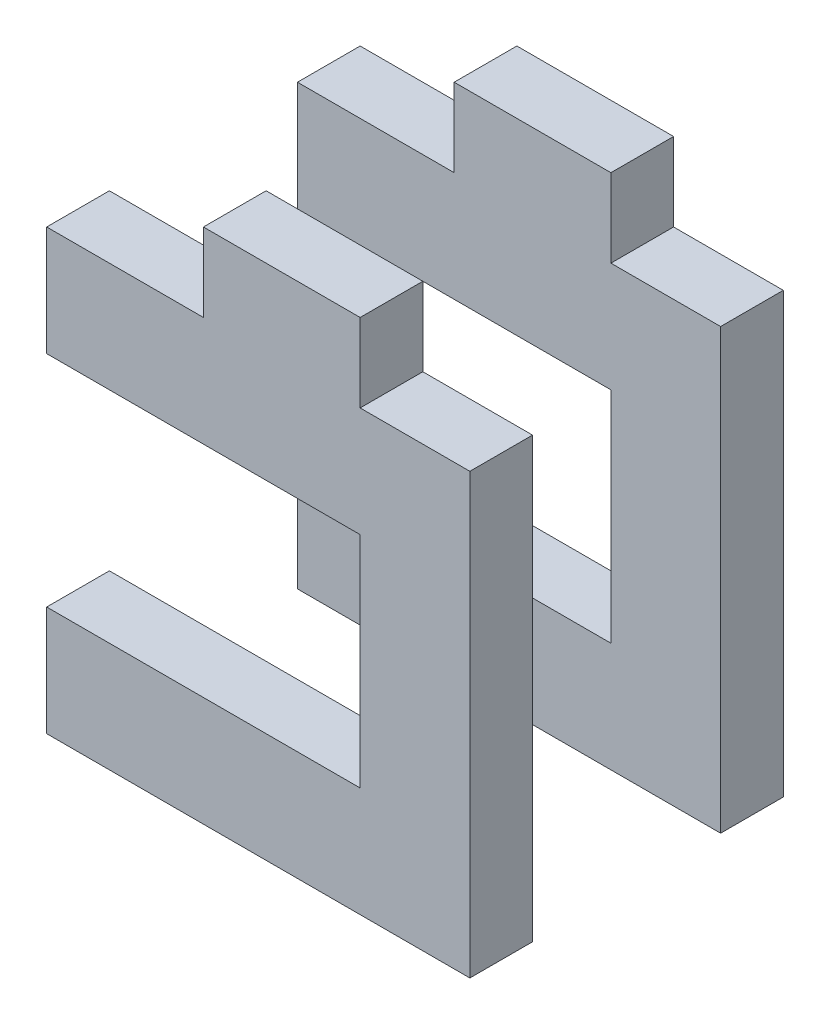
ISO-10303-21;
HEADER;
FILE_DESCRIPTION(('STEP AP214'),'2;1');
FILE_NAME('part.step','',(''),(''),'','','');
FILE_SCHEMA(('AUTOMOTIVE_DESIGN { 1 0 10303 214 1 1 1 1 }'));
ENDSEC;
DATA;
#1=APPLICATION_CONTEXT('core data for automotive mechanical design processes');
#2=APPLICATION_PROTOCOL_DEFINITION('international standard','automotive_design',2000,#1);
#3=PRODUCT_CONTEXT('',#1,'mechanical');
#4=PRODUCT('Part','Part','',(#3));
#5=PRODUCT_RELATED_PRODUCT_CATEGORY('part','',(#4));
#6=PRODUCT_DEFINITION_FORMATION('','',#4);
#7=PRODUCT_DEFINITION_CONTEXT('part definition',#1,'design');
#8=PRODUCT_DEFINITION('design','',#6,#7);
#9=PRODUCT_DEFINITION_SHAPE('','',#8);
#10=(LENGTH_UNIT() NAMED_UNIT(*) SI_UNIT(.MILLI.,.METRE.));
#11=(NAMED_UNIT(*) PLANE_ANGLE_UNIT() SI_UNIT($,.RADIAN.));
#12=(NAMED_UNIT(*) SI_UNIT($,.STERADIAN.) SOLID_ANGLE_UNIT());
#13=UNCERTAINTY_MEASURE_WITH_UNIT(LENGTH_MEASURE(1.E-05),#10,'distance_accuracy_value','');
#14=(GEOMETRIC_REPRESENTATION_CONTEXT(3) GLOBAL_UNCERTAINTY_ASSIGNED_CONTEXT((#13)) GLOBAL_UNIT_ASSIGNED_CONTEXT((#10,
#11,#12)) REPRESENTATION_CONTEXT('',''));
#15=CARTESIAN_POINT('',(0.,0.,0.));
#16=DIRECTION('',(0.,0.,1.));
#17=DIRECTION('',(1.,0.,0.));
#18=AXIS2_PLACEMENT_3D('',#15,#16,#17);
#19=CARTESIAN_POINT('',(7716.90697068349,2380.07008709242,10.));
#20=DIRECTION('',(0.,-1.,0.));
#21=DIRECTION('',(0.,0.,-1.));
#22=AXIS2_PLACEMENT_3D('',#19,#20,#21);
#23=PLANE('',#22);
#24=DIRECTION('',(-1.,0.,0.));
#25=VECTOR('',#24,1.);
#26=CARTESIAN_POINT('',(7716.90697068349,2380.07008709242,8.));
#27=LINE('',#26,#25);
#28=CARTESIAN_POINT('',(7716.90697068349,2380.07008709242,8.));
#29=VERTEX_POINT('',#28);
#30=CARTESIAN_POINT('',(7713.40697068349,2380.07008709242,8.));
#31=VERTEX_POINT('',#30);
#32=EDGE_CURVE('E172',#29,#31,#27,.T.);
#33=ORIENTED_EDGE('',*,*,#32,.T.);
#34=DIRECTION('',(0.,0.,-1.));
#35=VECTOR('',#34,1.);
#36=CARTESIAN_POINT('',(7713.40697068349,2380.07008709242,10.));
#37=LINE('',#36,#35);
#38=CARTESIAN_POINT('',(7713.40697068349,2380.07008709242,10.));
#39=VERTEX_POINT('',#38);
#40=EDGE_CURVE('E55',#39,#31,#37,.T.);
#41=ORIENTED_EDGE('',*,*,#40,.F.);
#42=DIRECTION('',(-1.,0.,0.));
#43=VECTOR('',#42,1.);
#44=CARTESIAN_POINT('',(7716.90697068349,2380.07008709242,10.));
#45=LINE('',#44,#43);
#46=CARTESIAN_POINT('',(7716.90697068349,2380.07008709242,10.));
#47=VERTEX_POINT('',#46);
#48=EDGE_CURVE('E118',#47,#39,#45,.T.);
#49=ORIENTED_EDGE('',*,*,#48,.F.);
#50=DIRECTION('',(0.,0.,-1.));
#51=VECTOR('',#50,1.);
#52=CARTESIAN_POINT('',(7716.90697068349,2380.07008709242,10.));
#53=LINE('',#52,#51);
#54=EDGE_CURVE('E12',#47,#29,#53,.T.);
#55=ORIENTED_EDGE('',*,*,#54,.T.);
#56=EDGE_LOOP('',(#33,#41,#49,#55));
#57=FACE_BOUND('',#56,.T.);
#58=ADVANCED_FACE('F47',(#57),#23,.F.);
#59=CARTESIAN_POINT('',(7713.40697068349,2380.07008709242,10.));
#60=DIRECTION('',(-1.,3.55271367880058E-13,0.));
#61=DIRECTION('',(-3.55271367880058E-13,-1.,0.));
#62=AXIS2_PLACEMENT_3D('',#59,#60,#61);
#63=PLANE('',#62);
#64=DIRECTION('',(3.55271367880058E-13,1.,0.));
#65=VECTOR('',#64,1.);
#66=CARTESIAN_POINT('',(7713.40697068349,2380.07008709242,8.));
#67=LINE('',#66,#65);
#68=CARTESIAN_POINT('',(7713.40697068349,2382.57008709242,8.));
#69=VERTEX_POINT('',#68);
#70=EDGE_CURVE('E174',#31,#69,#67,.T.);
#71=ORIENTED_EDGE('',*,*,#70,.T.);
#72=DIRECTION('',(0.,0.,-1.));
#73=VECTOR('',#72,1.);
#74=CARTESIAN_POINT('',(7713.40697068349,2382.57008709242,10.));
#75=LINE('',#74,#73);
#76=CARTESIAN_POINT('',(7713.40697068349,2382.57008709242,10.));
#77=VERTEX_POINT('',#76);
#78=EDGE_CURVE('E213',#77,#69,#75,.T.);
#79=ORIENTED_EDGE('',*,*,#78,.F.);
#80=DIRECTION('',(3.55271367880058E-13,1.,0.));
#81=VECTOR('',#80,1.);
#82=CARTESIAN_POINT('',(7713.40697068349,2380.07008709242,10.));
#83=LINE('',#82,#81);
#84=EDGE_CURVE('E220',#39,#77,#83,.T.);
#85=ORIENTED_EDGE('',*,*,#84,.F.);
#86=ORIENTED_EDGE('',*,*,#40,.T.);
#87=EDGE_LOOP('',(#71,#79,#85,#86));
#88=FACE_BOUND('',#87,.T.);
#89=ADVANCED_FACE('F218',(#88),#63,.F.);
#90=CARTESIAN_POINT('',(7708.40697068349,2382.57008709242,10.));
#91=DIRECTION('',(0.,1.,0.));
#92=DIRECTION('',(0.,0.,1.));
#93=AXIS2_PLACEMENT_3D('',#90,#91,#92);
#94=PLANE('',#93);
#95=DIRECTION('',(1.,0.,0.));
#96=VECTOR('',#95,1.);
#97=CARTESIAN_POINT('',(7708.40697068349,2382.57008709242,8.));
#98=LINE('',#97,#96);
#99=CARTESIAN_POINT('',(7708.40697068349,2382.57008709242,8.));
#100=VERTEX_POINT('',#99);
#101=EDGE_CURVE('E177',#100,#69,#98,.T.);
#102=ORIENTED_EDGE('',*,*,#101,.F.);
#103=DIRECTION('',(0.,0.,-1.));
#104=VECTOR('',#103,1.);
#105=CARTESIAN_POINT('',(7708.40697068349,2382.57008709242,10.));
#106=LINE('',#105,#104);
#107=CARTESIAN_POINT('',(7708.40697068349,2382.57008709242,10.));
#108=VERTEX_POINT('',#107);
#109=EDGE_CURVE('E211',#108,#100,#106,.T.);
#110=ORIENTED_EDGE('',*,*,#109,.F.);
#111=DIRECTION('',(1.,0.,0.));
#112=VECTOR('',#111,1.);
#113=CARTESIAN_POINT('',(7708.40697068349,2382.57008709242,10.));
#114=LINE('',#113,#112);
#115=EDGE_CURVE('E228',#108,#77,#114,.T.);
#116=ORIENTED_EDGE('',*,*,#115,.T.);
#117=ORIENTED_EDGE('',*,*,#78,.T.);
#118=EDGE_LOOP('',(#102,#110,#116,#117));
#119=FACE_BOUND('',#118,.T.);
#120=ADVANCED_FACE('F225',(#119),#94,.T.);
#121=CARTESIAN_POINT('',(7708.40697068349,2380.07008709242,10.));
#122=DIRECTION('',(-1.,0.,0.));
#123=DIRECTION('',(0.,0.,1.));
#124=AXIS2_PLACEMENT_3D('',#121,#122,#123);
#125=PLANE('',#124);
#126=DIRECTION('',(0.,1.,0.));
#127=VECTOR('',#126,1.);
#128=CARTESIAN_POINT('',(7708.40697068349,2380.07008709242,8.));
#129=LINE('',#128,#127);
#130=CARTESIAN_POINT('',(7708.40697068349,2380.07008709242,8.));
#131=VERTEX_POINT('',#130);
#132=EDGE_CURVE('E180',#131,#100,#129,.T.);
#133=ORIENTED_EDGE('',*,*,#132,.F.);
#134=DIRECTION('',(0.,0.,-1.));
#135=VECTOR('',#134,1.);
#136=CARTESIAN_POINT('',(7708.40697068349,2380.07008709242,10.));
#137=LINE('',#136,#135);
#138=CARTESIAN_POINT('',(7708.40697068349,2380.07008709242,10.));
#139=VERTEX_POINT('',#138);
#140=EDGE_CURVE('E209',#139,#131,#137,.T.);
#141=ORIENTED_EDGE('',*,*,#140,.F.);
#142=DIRECTION('',(0.,1.,0.));
#143=VECTOR('',#142,1.);
#144=CARTESIAN_POINT('',(7708.40697068349,2380.07008709242,10.));
#145=LINE('',#144,#143);
#146=EDGE_CURVE('E231',#139,#108,#145,.T.);
#147=ORIENTED_EDGE('',*,*,#146,.T.);
#148=ORIENTED_EDGE('',*,*,#109,.T.);
#149=EDGE_LOOP('',(#133,#141,#147,#148));
#150=FACE_BOUND('',#149,.T.);
#151=ADVANCED_FACE('F363',(#150),#125,.T.);
#152=CARTESIAN_POINT('',(7703.40697068349,2380.07008709242,10.));
#153=DIRECTION('',(0.,1.,0.));
#154=DIRECTION('',(0.,0.,1.));
#155=AXIS2_PLACEMENT_3D('',#152,#153,#154);
#156=PLANE('',#155);
#157=DIRECTION('',(1.,0.,0.));
#158=VECTOR('',#157,1.);
#159=CARTESIAN_POINT('',(7703.40697068349,2380.07008709242,8.));
#160=LINE('',#159,#158);
#161=CARTESIAN_POINT('',(7703.40697068349,2380.07008709242,8.));
#162=VERTEX_POINT('',#161);
#163=EDGE_CURVE('E183',#162,#131,#160,.T.);
#164=ORIENTED_EDGE('',*,*,#163,.F.);
#165=DIRECTION('',(0.,0.,-1.));
#166=VECTOR('',#165,1.);
#167=CARTESIAN_POINT('',(7703.40697068349,2380.07008709242,10.));
#168=LINE('',#167,#166);
#169=CARTESIAN_POINT('',(7703.40697068349,2380.07008709242,10.));
#170=VERTEX_POINT('',#169);
#171=EDGE_CURVE('E206',#170,#162,#168,.T.);
#172=ORIENTED_EDGE('',*,*,#171,.F.);
#173=DIRECTION('',(1.,0.,0.));
#174=VECTOR('',#173,1.);
#175=CARTESIAN_POINT('',(7703.40697068349,2380.07008709242,10.));
#176=LINE('',#175,#174);
#177=EDGE_CURVE('E233',#170,#139,#176,.T.);
#178=ORIENTED_EDGE('',*,*,#177,.T.);
#179=ORIENTED_EDGE('',*,*,#140,.T.);
#180=EDGE_LOOP('',(#164,#172,#178,#179));
#181=FACE_BOUND('',#180,.T.);
#182=ADVANCED_FACE('F352',(#181),#156,.T.);
#183=CARTESIAN_POINT('',(7703.40697068349,2376.57008709242,10.));
#184=DIRECTION('',(-1.,0.,0.));
#185=DIRECTION('',(0.,0.,1.));
#186=AXIS2_PLACEMENT_3D('',#183,#184,#185);
#187=PLANE('',#186);
#188=DIRECTION('',(0.,1.,0.));
#189=VECTOR('',#188,1.);
#190=CARTESIAN_POINT('',(7703.40697068349,2376.57008709242,8.));
#191=LINE('',#190,#189);
#192=CARTESIAN_POINT('',(7703.40697068349,2376.57008709242,8.));
#193=VERTEX_POINT('',#192);
#194=EDGE_CURVE('E186',#193,#162,#191,.T.);
#195=ORIENTED_EDGE('',*,*,#194,.F.);
#196=DIRECTION('',(0.,0.,-1.));
#197=VECTOR('',#196,1.);
#198=CARTESIAN_POINT('',(7703.40697068349,2376.57008709242,10.));
#199=LINE('',#198,#197);
#200=CARTESIAN_POINT('',(7703.40697068349,2376.57008709242,10.));
#201=VERTEX_POINT('',#200);
#202=EDGE_CURVE('E204',#201,#193,#199,.T.);
#203=ORIENTED_EDGE('',*,*,#202,.F.);
#204=DIRECTION('',(0.,1.,0.));
#205=VECTOR('',#204,1.);
#206=CARTESIAN_POINT('',(7703.40697068349,2378.57008709242,10.));
#207=LINE('',#206,#205);
#208=EDGE_CURVE('E240',#201,#170,#207,.T.);
#209=ORIENTED_EDGE('',*,*,#208,.T.);
#210=ORIENTED_EDGE('',*,*,#171,.T.);
#211=EDGE_LOOP('',(#195,#203,#209,#210));
#212=FACE_BOUND('',#211,.T.);
#213=ADVANCED_FACE('F252',(#212),#187,.T.);
#214=CARTESIAN_POINT('',(7713.40697068349,2376.57008709242,10.));
#215=DIRECTION('',(0.,-1.,0.));
#216=DIRECTION('',(0.,0.,-1.));
#217=AXIS2_PLACEMENT_3D('',#214,#215,#216);
#218=PLANE('',#217);
#219=DIRECTION('',(-1.,0.,0.));
#220=VECTOR('',#219,1.);
#221=CARTESIAN_POINT('',(7713.40697068349,2376.57008709242,8.));
#222=LINE('',#221,#220);
#223=CARTESIAN_POINT('',(7713.40697068349,2376.57008709242,8.));
#224=VERTEX_POINT('',#223);
#225=EDGE_CURVE('E188',#224,#193,#222,.T.);
#226=ORIENTED_EDGE('',*,*,#225,.F.);
#227=DIRECTION('',(0.,0.,-1.));
#228=VECTOR('',#227,1.);
#229=CARTESIAN_POINT('',(7713.40697068349,2376.57008709242,10.));
#230=LINE('',#229,#228);
#231=CARTESIAN_POINT('',(7713.40697068349,2376.57008709242,10.));
#232=VERTEX_POINT('',#231);
#233=EDGE_CURVE('E202',#232,#224,#230,.T.);
#234=ORIENTED_EDGE('',*,*,#233,.F.);
#235=DIRECTION('',(-1.,0.,0.));
#236=VECTOR('',#235,1.);
#237=CARTESIAN_POINT('',(7713.40697068349,2376.57008709242,10.));
#238=LINE('',#237,#236);
#239=EDGE_CURVE('E243',#232,#201,#238,.T.);
#240=ORIENTED_EDGE('',*,*,#239,.T.);
#241=ORIENTED_EDGE('',*,*,#202,.T.);
#242=EDGE_LOOP('',(#226,#234,#240,#241));
#243=FACE_BOUND('',#242,.T.);
#244=ADVANCED_FACE('F247',(#243),#218,.T.);
#245=CARTESIAN_POINT('',(7713.40697068349,2376.57008709242,10.));
#246=DIRECTION('',(1.,0.,0.));
#247=DIRECTION('',(0.,0.,-1.));
#248=AXIS2_PLACEMENT_3D('',#245,#246,#247);
#249=PLANE('',#248);
#250=DIRECTION('',(0.,-1.,0.));
#251=VECTOR('',#250,1.);
#252=CARTESIAN_POINT('',(7713.40697068349,2376.57008709242,8.));
#253=LINE('',#252,#251);
#254=CARTESIAN_POINT('',(7713.40697068349,2369.57008709242,8.));
#255=VERTEX_POINT('',#254);
#256=EDGE_CURVE('E191',#224,#255,#253,.T.);
#257=ORIENTED_EDGE('',*,*,#256,.T.);
#258=DIRECTION('',(0.,0.,-1.));
#259=VECTOR('',#258,1.);
#260=CARTESIAN_POINT('',(7713.40697068349,2369.57008709242,10.));
#261=LINE('',#260,#259);
#262=CARTESIAN_POINT('',(7713.40697068349,2369.57008709242,10.));
#263=VERTEX_POINT('',#262);
#264=EDGE_CURVE('E161',#263,#255,#261,.T.);
#265=ORIENTED_EDGE('',*,*,#264,.F.);
#266=DIRECTION('',(0.,-1.,0.));
#267=VECTOR('',#266,1.);
#268=CARTESIAN_POINT('',(7713.40697068349,2376.57008709242,10.));
#269=LINE('',#268,#267);
#270=EDGE_CURVE('E151',#232,#263,#269,.T.);
#271=ORIENTED_EDGE('',*,*,#270,.F.);
#272=ORIENTED_EDGE('',*,*,#233,.T.);
#273=EDGE_LOOP('',(#257,#265,#271,#272));
#274=FACE_BOUND('',#273,.T.);
#275=ADVANCED_FACE('F256',(#274),#249,.F.);
#276=CARTESIAN_POINT('',(7713.40697068349,2369.57008709242,10.));
#277=DIRECTION('',(0.,-1.,0.));
#278=DIRECTION('',(0.,0.,-1.));
#279=AXIS2_PLACEMENT_3D('',#276,#277,#278);
#280=PLANE('',#279);
#281=DIRECTION('',(-1.,0.,0.));
#282=VECTOR('',#281,1.);
#283=CARTESIAN_POINT('',(7713.40697068349,2369.57008709242,8.));
#284=LINE('',#283,#282);
#285=CARTESIAN_POINT('',(7703.40697068349,2369.57008709242,8.));
#286=VERTEX_POINT('',#285);
#287=EDGE_CURVE('E160',#255,#286,#284,.T.);
#288=ORIENTED_EDGE('',*,*,#287,.T.);
#289=DIRECTION('',(0.,0.,-1.));
#290=VECTOR('',#289,1.);
#291=CARTESIAN_POINT('',(7703.40697068349,2369.57008709242,10.));
#292=LINE('',#291,#290);
#293=CARTESIAN_POINT('',(7703.40697068349,2369.57008709242,10.));
#294=VERTEX_POINT('',#293);
#295=EDGE_CURVE('E157',#294,#286,#292,.T.);
#296=ORIENTED_EDGE('',*,*,#295,.F.);
#297=DIRECTION('',(-1.,0.,0.));
#298=VECTOR('',#297,1.);
#299=CARTESIAN_POINT('',(7713.40697068349,2369.57008709242,10.));
#300=LINE('',#299,#298);
#301=EDGE_CURVE('E144',#263,#294,#300,.T.);
#302=ORIENTED_EDGE('',*,*,#301,.F.);
#303=ORIENTED_EDGE('',*,*,#264,.T.);
#304=EDGE_LOOP('',(#288,#296,#302,#303));
#305=FACE_BOUND('',#304,.T.);
#306=ADVANCED_FACE('F158',(#305),#280,.F.);
#307=CARTESIAN_POINT('',(7703.40697068349,2367.57008709242,10.));
#308=DIRECTION('',(1.,0.,0.));
#309=DIRECTION('',(0.,0.,-1.));
#310=AXIS2_PLACEMENT_3D('',#307,#308,#309);
#311=PLANE('',#310);
#312=DIRECTION('',(0.,-1.,0.));
#313=VECTOR('',#312,1.);
#314=CARTESIAN_POINT('',(7703.40697068349,2367.57008709242,8.));
#315=LINE('',#314,#313);
#316=CARTESIAN_POINT('',(7703.40697068349,2366.07008709242,8.));
#317=VERTEX_POINT('',#316);
#318=EDGE_CURVE('E104',#286,#317,#315,.T.);
#319=ORIENTED_EDGE('',*,*,#318,.T.);
#320=DIRECTION('',(0.,0.,-1.));
#321=VECTOR('',#320,1.);
#322=CARTESIAN_POINT('',(7703.40697068349,2366.07008709242,10.));
#323=LINE('',#322,#321);
#324=CARTESIAN_POINT('',(7703.40697068349,2366.07008709242,10.));
#325=VERTEX_POINT('',#324);
#326=EDGE_CURVE('E162',#325,#317,#323,.T.);
#327=ORIENTED_EDGE('',*,*,#326,.F.);
#328=DIRECTION('',(0.,-1.,0.));
#329=VECTOR('',#328,1.);
#330=CARTESIAN_POINT('',(7703.40697068349,2369.57008709242,10.));
#331=LINE('',#330,#329);
#332=EDGE_CURVE('E148',#294,#325,#331,.T.);
#333=ORIENTED_EDGE('',*,*,#332,.F.);
#334=ORIENTED_EDGE('',*,*,#295,.T.);
#335=EDGE_LOOP('',(#319,#327,#333,#334));
#336=FACE_BOUND('',#335,.T.);
#337=ADVANCED_FACE('F164',(#336),#311,.F.);
#338=CARTESIAN_POINT('',(7703.40697068349,2366.07008709242,10.));
#339=DIRECTION('',(0.,1.,0.));
#340=DIRECTION('',(0.,0.,1.));
#341=AXIS2_PLACEMENT_3D('',#338,#339,#340);
#342=PLANE('',#341);
#343=DIRECTION('',(1.,0.,0.));
#344=VECTOR('',#343,1.);
#345=CARTESIAN_POINT('',(7703.40697068349,2366.07008709242,8.));
#346=LINE('',#345,#344);
#347=CARTESIAN_POINT('',(7716.90697068349,2366.07008709242,8.));
#348=VERTEX_POINT('',#347);
#349=EDGE_CURVE('E195',#317,#348,#346,.T.);
#350=ORIENTED_EDGE('',*,*,#349,.T.);
#351=DIRECTION('',(0.,0.,-1.));
#352=VECTOR('',#351,1.);
#353=CARTESIAN_POINT('',(7716.90697068349,2366.07008709242,10.));
#354=LINE('',#353,#352);
#355=CARTESIAN_POINT('',(7716.90697068349,2366.07008709242,10.));
#356=VERTEX_POINT('',#355);
#357=EDGE_CURVE('E168',#356,#348,#354,.T.);
#358=ORIENTED_EDGE('',*,*,#357,.F.);
#359=DIRECTION('',(1.,0.,0.));
#360=VECTOR('',#359,1.);
#361=CARTESIAN_POINT('',(7703.40697068349,2366.07008709242,10.));
#362=LINE('',#361,#360);
#363=EDGE_CURVE('E166',#325,#356,#362,.T.);
#364=ORIENTED_EDGE('',*,*,#363,.F.);
#365=ORIENTED_EDGE('',*,*,#326,.T.);
#366=EDGE_LOOP('',(#350,#358,#364,#365));
#367=FACE_BOUND('',#366,.T.);
#368=ADVANCED_FACE('F272',(#367),#342,.F.);
#369=CARTESIAN_POINT('',(7716.90697068349,2367.57008709242,10.));
#370=DIRECTION('',(-1.,0.,0.));
#371=DIRECTION('',(0.,0.,1.));
#372=AXIS2_PLACEMENT_3D('',#369,#370,#371);
#373=PLANE('',#372);
#374=DIRECTION('',(0.,1.,0.));
#375=VECTOR('',#374,1.);
#376=CARTESIAN_POINT('',(7716.90697068349,2367.57008709242,8.));
#377=LINE('',#376,#375);
#378=EDGE_CURVE('E111',#348,#29,#377,.T.);
#379=ORIENTED_EDGE('',*,*,#378,.T.);
#380=ORIENTED_EDGE('',*,*,#54,.F.);
#381=DIRECTION('',(0.,1.,0.));
#382=VECTOR('',#381,1.);
#383=CARTESIAN_POINT('',(7716.90697068349,2378.57008709242,10.));
#384=LINE('',#383,#382);
#385=EDGE_CURVE('E63',#356,#47,#384,.T.);
#386=ORIENTED_EDGE('',*,*,#385,.F.);
#387=ORIENTED_EDGE('',*,*,#357,.T.);
#388=EDGE_LOOP('',(#379,#380,#386,#387));
#389=FACE_BOUND('',#388,.T.);
#390=ADVANCED_FACE('F269',(#389),#373,.F.);
#391=CARTESIAN_POINT('',(0.,0.,10.));
#392=DIRECTION('',(0.,0.,1.));
#393=DIRECTION('',(1.,0.,0.));
#394=AXIS2_PLACEMENT_3D('',#391,#392,#393);
#395=PLANE('',#394);
#396=ORIENTED_EDGE('',*,*,#385,.T.);
#397=ORIENTED_EDGE('',*,*,#48,.T.);
#398=ORIENTED_EDGE('',*,*,#84,.T.);
#399=ORIENTED_EDGE('',*,*,#115,.F.);
#400=ORIENTED_EDGE('',*,*,#146,.F.);
#401=ORIENTED_EDGE('',*,*,#177,.F.);
#402=ORIENTED_EDGE('',*,*,#208,.F.);
#403=ORIENTED_EDGE('',*,*,#239,.F.);
#404=ORIENTED_EDGE('',*,*,#270,.T.);
#405=ORIENTED_EDGE('',*,*,#301,.T.);
#406=ORIENTED_EDGE('',*,*,#332,.T.);
#407=ORIENTED_EDGE('',*,*,#363,.T.);
#408=EDGE_LOOP('',(#396,#397,#398,#399,#400,#401,#402,#403,#404,#405,#406,#407));
#409=FACE_BOUND('',#408,.T.);
#410=ADVANCED_FACE('F146',(#409),#395,.T.);
#411=CARTESIAN_POINT('',(0.,0.,8.));
#412=DIRECTION('',(0.,0.,1.));
#413=DIRECTION('',(1.,0.,0.));
#414=AXIS2_PLACEMENT_3D('',#411,#412,#413);
#415=PLANE('',#414);
#416=ORIENTED_EDGE('',*,*,#32,.F.);
#417=ORIENTED_EDGE('',*,*,#378,.F.);
#418=ORIENTED_EDGE('',*,*,#349,.F.);
#419=ORIENTED_EDGE('',*,*,#318,.F.);
#420=ORIENTED_EDGE('',*,*,#287,.F.);
#421=ORIENTED_EDGE('',*,*,#256,.F.);
#422=ORIENTED_EDGE('',*,*,#225,.T.);
#423=ORIENTED_EDGE('',*,*,#194,.T.);
#424=ORIENTED_EDGE('',*,*,#163,.T.);
#425=ORIENTED_EDGE('',*,*,#132,.T.);
#426=ORIENTED_EDGE('',*,*,#101,.T.);
#427=ORIENTED_EDGE('',*,*,#70,.F.);
#428=EDGE_LOOP('',(#416,#417,#418,#419,#420,#421,#422,#423,#424,#425,#426,#427));
#429=FACE_BOUND('',#428,.T.);
#430=ADVANCED_FACE('F221',(#429),#415,.F.);
#431=CLOSED_SHELL('',(#58,#89,#120,#151,#182,#213,#244,#275,#306,#337,#368,#390,#410,#430));
#432=MANIFOLD_SOLID_BREP('B2',#431);
#433=CARTESIAN_POINT('',(7716.90697068349,2380.07008709242,2.));
#434=DIRECTION('',(0.,-1.,0.));
#435=DIRECTION('',(0.,0.,-1.));
#436=AXIS2_PLACEMENT_3D('',#433,#434,#435);
#437=PLANE('',#436);
#438=DIRECTION('',(-1.,0.,0.));
#439=VECTOR('',#438,1.);
#440=CARTESIAN_POINT('',(7716.90697068349,2380.07008709242,0.));
#441=LINE('',#440,#439);
#442=CARTESIAN_POINT('',(7716.90697068349,2380.07008709242,0.));
#443=VERTEX_POINT('',#442);
#444=CARTESIAN_POINT('',(7713.40697068349,2380.07008709242,0.));
#445=VERTEX_POINT('',#444);
#446=EDGE_CURVE('E544',#443,#445,#441,.T.);
#447=ORIENTED_EDGE('',*,*,#446,.T.);
#448=DIRECTION('',(0.,0.,-1.));
#449=VECTOR('',#448,1.);
#450=CARTESIAN_POINT('',(7713.40697068349,2380.07008709242,2.));
#451=LINE('',#450,#449);
#452=CARTESIAN_POINT('',(7713.40697068349,2380.07008709242,2.));
#453=VERTEX_POINT('',#452);
#454=EDGE_CURVE('E427',#453,#445,#451,.T.);
#455=ORIENTED_EDGE('',*,*,#454,.F.);
#456=DIRECTION('',(-1.,0.,0.));
#457=VECTOR('',#456,1.);
#458=CARTESIAN_POINT('',(7716.90697068349,2380.07008709242,2.));
#459=LINE('',#458,#457);
#460=CARTESIAN_POINT('',(7716.90697068349,2380.07008709242,2.));
#461=VERTEX_POINT('',#460);
#462=EDGE_CURVE('E490',#461,#453,#459,.T.);
#463=ORIENTED_EDGE('',*,*,#462,.F.);
#464=DIRECTION('',(0.,0.,-1.));
#465=VECTOR('',#464,1.);
#466=CARTESIAN_POINT('',(7716.90697068349,2380.07008709242,2.));
#467=LINE('',#466,#465);
#468=EDGE_CURVE('E45',#461,#443,#467,.T.);
#469=ORIENTED_EDGE('',*,*,#468,.T.);
#470=EDGE_LOOP('',(#447,#455,#463,#469));
#471=FACE_BOUND('',#470,.T.);
#472=ADVANCED_FACE('F419',(#471),#437,.F.);
#473=CARTESIAN_POINT('',(7713.40697068349,2380.07008709242,2.));
#474=DIRECTION('',(-1.,3.55271367880058E-13,0.));
#475=DIRECTION('',(-3.55271367880058E-13,-1.,0.));
#476=AXIS2_PLACEMENT_3D('',#473,#474,#475);
#477=PLANE('',#476);
#478=DIRECTION('',(3.55271367880058E-13,1.,0.));
#479=VECTOR('',#478,1.);
#480=CARTESIAN_POINT('',(7713.40697068349,2380.07008709242,0.));
#481=LINE('',#480,#479);
#482=CARTESIAN_POINT('',(7713.40697068349,2382.57008709242,0.));
#483=VERTEX_POINT('',#482);
#484=EDGE_CURVE('E546',#445,#483,#481,.T.);
#485=ORIENTED_EDGE('',*,*,#484,.T.);
#486=DIRECTION('',(0.,0.,-1.));
#487=VECTOR('',#486,1.);
#488=CARTESIAN_POINT('',(7713.40697068349,2382.57008709242,2.));
#489=LINE('',#488,#487);
#490=CARTESIAN_POINT('',(7713.40697068349,2382.57008709242,2.));
#491=VERTEX_POINT('',#490);
#492=EDGE_CURVE('E585',#491,#483,#489,.T.);
#493=ORIENTED_EDGE('',*,*,#492,.F.);
#494=DIRECTION('',(3.55271367880058E-13,1.,0.));
#495=VECTOR('',#494,1.);
#496=CARTESIAN_POINT('',(7713.40697068349,2380.07008709242,2.));
#497=LINE('',#496,#495);
#498=EDGE_CURVE('E592',#453,#491,#497,.T.);
#499=ORIENTED_EDGE('',*,*,#498,.F.);
#500=ORIENTED_EDGE('',*,*,#454,.T.);
#501=EDGE_LOOP('',(#485,#493,#499,#500));
#502=FACE_BOUND('',#501,.T.);
#503=ADVANCED_FACE('F590',(#502),#477,.F.);
#504=CARTESIAN_POINT('',(7708.40697068349,2382.57008709242,2.));
#505=DIRECTION('',(0.,1.,0.));
#506=DIRECTION('',(0.,0.,1.));
#507=AXIS2_PLACEMENT_3D('',#504,#505,#506);
#508=PLANE('',#507);
#509=DIRECTION('',(1.,0.,0.));
#510=VECTOR('',#509,1.);
#511=CARTESIAN_POINT('',(7708.40697068349,2382.57008709242,0.));
#512=LINE('',#511,#510);
#513=CARTESIAN_POINT('',(7708.40697068349,2382.57008709242,0.));
#514=VERTEX_POINT('',#513);
#515=EDGE_CURVE('E549',#514,#483,#512,.T.);
#516=ORIENTED_EDGE('',*,*,#515,.F.);
#517=DIRECTION('',(0.,0.,-1.));
#518=VECTOR('',#517,1.);
#519=CARTESIAN_POINT('',(7708.40697068349,2382.57008709242,2.));
#520=LINE('',#519,#518);
#521=CARTESIAN_POINT('',(7708.40697068349,2382.57008709242,2.));
#522=VERTEX_POINT('',#521);
#523=EDGE_CURVE('E583',#522,#514,#520,.T.);
#524=ORIENTED_EDGE('',*,*,#523,.F.);
#525=DIRECTION('',(1.,0.,0.));
#526=VECTOR('',#525,1.);
#527=CARTESIAN_POINT('',(7708.40697068349,2382.57008709242,2.));
#528=LINE('',#527,#526);
#529=EDGE_CURVE('E600',#522,#491,#528,.T.);
#530=ORIENTED_EDGE('',*,*,#529,.T.);
#531=ORIENTED_EDGE('',*,*,#492,.T.);
#532=EDGE_LOOP('',(#516,#524,#530,#531));
#533=FACE_BOUND('',#532,.T.);
#534=ADVANCED_FACE('F597',(#533),#508,.T.);
#535=CARTESIAN_POINT('',(7708.40697068349,2380.07008709242,2.));
#536=DIRECTION('',(-1.,0.,0.));
#537=DIRECTION('',(0.,0.,1.));
#538=AXIS2_PLACEMENT_3D('',#535,#536,#537);
#539=PLANE('',#538);
#540=DIRECTION('',(0.,1.,0.));
#541=VECTOR('',#540,1.);
#542=CARTESIAN_POINT('',(7708.40697068349,2380.07008709242,0.));
#543=LINE('',#542,#541);
#544=CARTESIAN_POINT('',(7708.40697068349,2380.07008709242,0.));
#545=VERTEX_POINT('',#544);
#546=EDGE_CURVE('E552',#545,#514,#543,.T.);
#547=ORIENTED_EDGE('',*,*,#546,.F.);
#548=DIRECTION('',(0.,0.,-1.));
#549=VECTOR('',#548,1.);
#550=CARTESIAN_POINT('',(7708.40697068349,2380.07008709242,2.));
#551=LINE('',#550,#549);
#552=CARTESIAN_POINT('',(7708.40697068349,2380.07008709242,2.));
#553=VERTEX_POINT('',#552);
#554=EDGE_CURVE('E581',#553,#545,#551,.T.);
#555=ORIENTED_EDGE('',*,*,#554,.F.);
#556=DIRECTION('',(0.,1.,0.));
#557=VECTOR('',#556,1.);
#558=CARTESIAN_POINT('',(7708.40697068349,2380.07008709242,2.));
#559=LINE('',#558,#557);
#560=EDGE_CURVE('E603',#553,#522,#559,.T.);
#561=ORIENTED_EDGE('',*,*,#560,.T.);
#562=ORIENTED_EDGE('',*,*,#523,.T.);
#563=EDGE_LOOP('',(#547,#555,#561,#562));
#564=FACE_BOUND('',#563,.T.);
#565=ADVANCED_FACE('F722',(#564),#539,.T.);
#566=CARTESIAN_POINT('',(7703.40697068349,2380.07008709242,2.));
#567=DIRECTION('',(0.,1.,0.));
#568=DIRECTION('',(0.,0.,1.));
#569=AXIS2_PLACEMENT_3D('',#566,#567,#568);
#570=PLANE('',#569);
#571=DIRECTION('',(1.,0.,0.));
#572=VECTOR('',#571,1.);
#573=CARTESIAN_POINT('',(7703.40697068349,2380.07008709242,0.));
#574=LINE('',#573,#572);
#575=CARTESIAN_POINT('',(7703.40697068349,2380.07008709242,0.));
#576=VERTEX_POINT('',#575);
#577=EDGE_CURVE('E555',#576,#545,#574,.T.);
#578=ORIENTED_EDGE('',*,*,#577,.F.);
#579=DIRECTION('',(0.,0.,-1.));
#580=VECTOR('',#579,1.);
#581=CARTESIAN_POINT('',(7703.40697068349,2380.07008709242,2.));
#582=LINE('',#581,#580);
#583=CARTESIAN_POINT('',(7703.40697068349,2380.07008709242,2.));
#584=VERTEX_POINT('',#583);
#585=EDGE_CURVE('E578',#584,#576,#582,.T.);
#586=ORIENTED_EDGE('',*,*,#585,.F.);
#587=DIRECTION('',(1.,0.,0.));
#588=VECTOR('',#587,1.);
#589=CARTESIAN_POINT('',(7703.40697068349,2380.07008709242,2.));
#590=LINE('',#589,#588);
#591=EDGE_CURVE('E605',#584,#553,#590,.T.);
#592=ORIENTED_EDGE('',*,*,#591,.T.);
#593=ORIENTED_EDGE('',*,*,#554,.T.);
#594=EDGE_LOOP('',(#578,#586,#592,#593));
#595=FACE_BOUND('',#594,.T.);
#596=ADVANCED_FACE('F712',(#595),#570,.T.);
#597=CARTESIAN_POINT('',(7703.40697068349,2376.57008709242,2.));
#598=DIRECTION('',(-1.,0.,0.));
#599=DIRECTION('',(0.,0.,1.));
#600=AXIS2_PLACEMENT_3D('',#597,#598,#599);
#601=PLANE('',#600);
#602=DIRECTION('',(0.,1.,0.));
#603=VECTOR('',#602,1.);
#604=CARTESIAN_POINT('',(7703.40697068349,2376.57008709242,0.));
#605=LINE('',#604,#603);
#606=CARTESIAN_POINT('',(7703.40697068349,2376.57008709242,0.));
#607=VERTEX_POINT('',#606);
#608=EDGE_CURVE('E558',#607,#576,#605,.T.);
#609=ORIENTED_EDGE('',*,*,#608,.F.);
#610=DIRECTION('',(0.,0.,-1.));
#611=VECTOR('',#610,1.);
#612=CARTESIAN_POINT('',(7703.40697068349,2376.57008709242,2.));
#613=LINE('',#612,#611);
#614=CARTESIAN_POINT('',(7703.40697068349,2376.57008709242,2.));
#615=VERTEX_POINT('',#614);
#616=EDGE_CURVE('E576',#615,#607,#613,.T.);
#617=ORIENTED_EDGE('',*,*,#616,.F.);
#618=DIRECTION('',(0.,1.,0.));
#619=VECTOR('',#618,1.);
#620=CARTESIAN_POINT('',(7703.40697068349,2378.57008709242,2.));
#621=LINE('',#620,#619);
#622=EDGE_CURVE('E612',#615,#584,#621,.T.);
#623=ORIENTED_EDGE('',*,*,#622,.T.);
#624=ORIENTED_EDGE('',*,*,#585,.T.);
#625=EDGE_LOOP('',(#609,#617,#623,#624));
#626=FACE_BOUND('',#625,.T.);
#627=ADVANCED_FACE('F624',(#626),#601,.T.);
#628=CARTESIAN_POINT('',(7713.40697068349,2376.57008709242,2.));
#629=DIRECTION('',(0.,-1.,0.));
#630=DIRECTION('',(0.,0.,-1.));
#631=AXIS2_PLACEMENT_3D('',#628,#629,#630);
#632=PLANE('',#631);
#633=DIRECTION('',(-1.,0.,0.));
#634=VECTOR('',#633,1.);
#635=CARTESIAN_POINT('',(7713.40697068349,2376.57008709242,0.));
#636=LINE('',#635,#634);
#637=CARTESIAN_POINT('',(7713.40697068349,2376.57008709242,0.));
#638=VERTEX_POINT('',#637);
#639=EDGE_CURVE('E560',#638,#607,#636,.T.);
#640=ORIENTED_EDGE('',*,*,#639,.F.);
#641=DIRECTION('',(0.,0.,-1.));
#642=VECTOR('',#641,1.);
#643=CARTESIAN_POINT('',(7713.40697068349,2376.57008709242,2.));
#644=LINE('',#643,#642);
#645=CARTESIAN_POINT('',(7713.40697068349,2376.57008709242,2.));
#646=VERTEX_POINT('',#645);
#647=EDGE_CURVE('E574',#646,#638,#644,.T.);
#648=ORIENTED_EDGE('',*,*,#647,.F.);
#649=DIRECTION('',(-1.,0.,0.));
#650=VECTOR('',#649,1.);
#651=CARTESIAN_POINT('',(7713.40697068349,2376.57008709242,2.));
#652=LINE('',#651,#650);
#653=EDGE_CURVE('E615',#646,#615,#652,.T.);
#654=ORIENTED_EDGE('',*,*,#653,.T.);
#655=ORIENTED_EDGE('',*,*,#616,.T.);
#656=EDGE_LOOP('',(#640,#648,#654,#655));
#657=FACE_BOUND('',#656,.T.);
#658=ADVANCED_FACE('F619',(#657),#632,.T.);
#659=CARTESIAN_POINT('',(7713.40697068349,2376.57008709242,2.));
#660=DIRECTION('',(1.,0.,0.));
#661=DIRECTION('',(0.,0.,-1.));
#662=AXIS2_PLACEMENT_3D('',#659,#660,#661);
#663=PLANE('',#662);
#664=DIRECTION('',(0.,-1.,0.));
#665=VECTOR('',#664,1.);
#666=CARTESIAN_POINT('',(7713.40697068349,2376.57008709242,0.));
#667=LINE('',#666,#665);
#668=CARTESIAN_POINT('',(7713.40697068349,2369.57008709242,0.));
#669=VERTEX_POINT('',#668);
#670=EDGE_CURVE('E563',#638,#669,#667,.T.);
#671=ORIENTED_EDGE('',*,*,#670,.T.);
#672=DIRECTION('',(0.,0.,-1.));
#673=VECTOR('',#672,1.);
#674=CARTESIAN_POINT('',(7713.40697068349,2369.57008709242,2.));
#675=LINE('',#674,#673);
#676=CARTESIAN_POINT('',(7713.40697068349,2369.57008709242,2.));
#677=VERTEX_POINT('',#676);
#678=EDGE_CURVE('E533',#677,#669,#675,.T.);
#679=ORIENTED_EDGE('',*,*,#678,.F.);
#680=DIRECTION('',(0.,-1.,0.));
#681=VECTOR('',#680,1.);
#682=CARTESIAN_POINT('',(7713.40697068349,2376.57008709242,2.));
#683=LINE('',#682,#681);
#684=EDGE_CURVE('E523',#646,#677,#683,.T.);
#685=ORIENTED_EDGE('',*,*,#684,.F.);
#686=ORIENTED_EDGE('',*,*,#647,.T.);
#687=EDGE_LOOP('',(#671,#679,#685,#686));
#688=FACE_BOUND('',#687,.T.);
#689=ADVANCED_FACE('F628',(#688),#663,.F.);
#690=CARTESIAN_POINT('',(7713.40697068349,2369.57008709242,2.));
#691=DIRECTION('',(0.,-1.,0.));
#692=DIRECTION('',(0.,0.,-1.));
#693=AXIS2_PLACEMENT_3D('',#690,#691,#692);
#694=PLANE('',#693);
#695=DIRECTION('',(-1.,0.,0.));
#696=VECTOR('',#695,1.);
#697=CARTESIAN_POINT('',(7713.40697068349,2369.57008709242,0.));
#698=LINE('',#697,#696);
#699=CARTESIAN_POINT('',(7703.40697068349,2369.57008709242,0.));
#700=VERTEX_POINT('',#699);
#701=EDGE_CURVE('E532',#669,#700,#698,.T.);
#702=ORIENTED_EDGE('',*,*,#701,.T.);
#703=DIRECTION('',(0.,0.,-1.));
#704=VECTOR('',#703,1.);
#705=CARTESIAN_POINT('',(7703.40697068349,2369.57008709242,2.));
#706=LINE('',#705,#704);
#707=CARTESIAN_POINT('',(7703.40697068349,2369.57008709242,2.));
#708=VERTEX_POINT('',#707);
#709=EDGE_CURVE('E529',#708,#700,#706,.T.);
#710=ORIENTED_EDGE('',*,*,#709,.F.);
#711=DIRECTION('',(-1.,0.,0.));
#712=VECTOR('',#711,1.);
#713=CARTESIAN_POINT('',(7713.40697068349,2369.57008709242,2.));
#714=LINE('',#713,#712);
#715=EDGE_CURVE('E516',#677,#708,#714,.T.);
#716=ORIENTED_EDGE('',*,*,#715,.F.);
#717=ORIENTED_EDGE('',*,*,#678,.T.);
#718=EDGE_LOOP('',(#702,#710,#716,#717));
#719=FACE_BOUND('',#718,.T.);
#720=ADVANCED_FACE('F530',(#719),#694,.F.);
#721=CARTESIAN_POINT('',(7703.40697068349,2367.57008709242,2.));
#722=DIRECTION('',(1.,0.,0.));
#723=DIRECTION('',(0.,0.,-1.));
#724=AXIS2_PLACEMENT_3D('',#721,#722,#723);
#725=PLANE('',#724);
#726=DIRECTION('',(0.,-1.,0.));
#727=VECTOR('',#726,1.);
#728=CARTESIAN_POINT('',(7703.40697068349,2367.57008709242,0.));
#729=LINE('',#728,#727);
#730=CARTESIAN_POINT('',(7703.40697068349,2366.07008709242,0.));
#731=VERTEX_POINT('',#730);
#732=EDGE_CURVE('E476',#700,#731,#729,.T.);
#733=ORIENTED_EDGE('',*,*,#732,.T.);
#734=DIRECTION('',(0.,0.,-1.));
#735=VECTOR('',#734,1.);
#736=CARTESIAN_POINT('',(7703.40697068349,2366.07008709242,2.));
#737=LINE('',#736,#735);
#738=CARTESIAN_POINT('',(7703.40697068349,2366.07008709242,2.));
#739=VERTEX_POINT('',#738);
#740=EDGE_CURVE('E534',#739,#731,#737,.T.);
#741=ORIENTED_EDGE('',*,*,#740,.F.);
#742=DIRECTION('',(0.,-1.,0.));
#743=VECTOR('',#742,1.);
#744=CARTESIAN_POINT('',(7703.40697068349,2369.57008709242,2.));
#745=LINE('',#744,#743);
#746=EDGE_CURVE('E520',#708,#739,#745,.T.);
#747=ORIENTED_EDGE('',*,*,#746,.F.);
#748=ORIENTED_EDGE('',*,*,#709,.T.);
#749=EDGE_LOOP('',(#733,#741,#747,#748));
#750=FACE_BOUND('',#749,.T.);
#751=ADVANCED_FACE('F536',(#750),#725,.F.);
#752=CARTESIAN_POINT('',(7703.40697068349,2366.07008709242,2.));
#753=DIRECTION('',(0.,1.,0.));
#754=DIRECTION('',(0.,0.,1.));
#755=AXIS2_PLACEMENT_3D('',#752,#753,#754);
#756=PLANE('',#755);
#757=DIRECTION('',(1.,0.,0.));
#758=VECTOR('',#757,1.);
#759=CARTESIAN_POINT('',(7703.40697068349,2366.07008709242,0.));
#760=LINE('',#759,#758);
#761=CARTESIAN_POINT('',(7716.90697068349,2366.07008709242,0.));
#762=VERTEX_POINT('',#761);
#763=EDGE_CURVE('E567',#731,#762,#760,.T.);
#764=ORIENTED_EDGE('',*,*,#763,.T.);
#765=DIRECTION('',(0.,0.,-1.));
#766=VECTOR('',#765,1.);
#767=CARTESIAN_POINT('',(7716.90697068349,2366.07008709242,2.));
#768=LINE('',#767,#766);
#769=CARTESIAN_POINT('',(7716.90697068349,2366.07008709242,2.));
#770=VERTEX_POINT('',#769);
#771=EDGE_CURVE('E540',#770,#762,#768,.T.);
#772=ORIENTED_EDGE('',*,*,#771,.F.);
#773=DIRECTION('',(1.,0.,0.));
#774=VECTOR('',#773,1.);
#775=CARTESIAN_POINT('',(7703.40697068349,2366.07008709242,2.));
#776=LINE('',#775,#774);
#777=EDGE_CURVE('E538',#739,#770,#776,.T.);
#778=ORIENTED_EDGE('',*,*,#777,.F.);
#779=ORIENTED_EDGE('',*,*,#740,.T.);
#780=EDGE_LOOP('',(#764,#772,#778,#779));
#781=FACE_BOUND('',#780,.T.);
#782=ADVANCED_FACE('F644',(#781),#756,.F.);
#783=CARTESIAN_POINT('',(7716.90697068349,2367.57008709242,2.));
#784=DIRECTION('',(-1.,0.,0.));
#785=DIRECTION('',(0.,0.,1.));
#786=AXIS2_PLACEMENT_3D('',#783,#784,#785);
#787=PLANE('',#786);
#788=DIRECTION('',(0.,1.,0.));
#789=VECTOR('',#788,1.);
#790=CARTESIAN_POINT('',(7716.90697068349,2367.57008709242,0.));
#791=LINE('',#790,#789);
#792=EDGE_CURVE('E483',#762,#443,#791,.T.);
#793=ORIENTED_EDGE('',*,*,#792,.T.);
#794=ORIENTED_EDGE('',*,*,#468,.F.);
#795=DIRECTION('',(0.,1.,0.));
#796=VECTOR('',#795,1.);
#797=CARTESIAN_POINT('',(7716.90697068349,2378.57008709242,2.));
#798=LINE('',#797,#796);
#799=EDGE_CURVE('E435',#770,#461,#798,.T.);
#800=ORIENTED_EDGE('',*,*,#799,.F.);
#801=ORIENTED_EDGE('',*,*,#771,.T.);
#802=EDGE_LOOP('',(#793,#794,#800,#801));
#803=FACE_BOUND('',#802,.T.);
#804=ADVANCED_FACE('F641',(#803),#787,.F.);
#805=CARTESIAN_POINT('',(0.,0.,2.));
#806=DIRECTION('',(0.,0.,1.));
#807=DIRECTION('',(1.,0.,0.));
#808=AXIS2_PLACEMENT_3D('',#805,#806,#807);
#809=PLANE('',#808);
#810=ORIENTED_EDGE('',*,*,#799,.T.);
#811=ORIENTED_EDGE('',*,*,#462,.T.);
#812=ORIENTED_EDGE('',*,*,#498,.T.);
#813=ORIENTED_EDGE('',*,*,#529,.F.);
#814=ORIENTED_EDGE('',*,*,#560,.F.);
#815=ORIENTED_EDGE('',*,*,#591,.F.);
#816=ORIENTED_EDGE('',*,*,#622,.F.);
#817=ORIENTED_EDGE('',*,*,#653,.F.);
#818=ORIENTED_EDGE('',*,*,#684,.T.);
#819=ORIENTED_EDGE('',*,*,#715,.T.);
#820=ORIENTED_EDGE('',*,*,#746,.T.);
#821=ORIENTED_EDGE('',*,*,#777,.T.);
#822=EDGE_LOOP('',(#810,#811,#812,#813,#814,#815,#816,#817,#818,#819,#820,#821));
#823=FACE_BOUND('',#822,.T.);
#824=ADVANCED_FACE('F518',(#823),#809,.T.);
#825=CARTESIAN_POINT('',(0.,0.,0.));
#826=DIRECTION('',(0.,0.,1.));
#827=DIRECTION('',(1.,0.,0.));
#828=AXIS2_PLACEMENT_3D('',#825,#826,#827);
#829=PLANE('',#828);
#830=ORIENTED_EDGE('',*,*,#446,.F.);
#831=ORIENTED_EDGE('',*,*,#792,.F.);
#832=ORIENTED_EDGE('',*,*,#763,.F.);
#833=ORIENTED_EDGE('',*,*,#732,.F.);
#834=ORIENTED_EDGE('',*,*,#701,.F.);
#835=ORIENTED_EDGE('',*,*,#670,.F.);
#836=ORIENTED_EDGE('',*,*,#639,.T.);
#837=ORIENTED_EDGE('',*,*,#608,.T.);
#838=ORIENTED_EDGE('',*,*,#577,.T.);
#839=ORIENTED_EDGE('',*,*,#546,.T.);
#840=ORIENTED_EDGE('',*,*,#515,.T.);
#841=ORIENTED_EDGE('',*,*,#484,.F.);
#842=EDGE_LOOP('',(#830,#831,#832,#833,#834,#835,#836,#837,#838,#839,#840,#841));
#843=FACE_BOUND('',#842,.T.);
#844=ADVANCED_FACE('F593',(#843),#829,.F.);
#845=CLOSED_SHELL('',(#472,#503,#534,#565,#596,#627,#658,#689,#720,#751,#782,#804,#824,#844));
#846=MANIFOLD_SOLID_BREP('B6',#845);
#847=ADVANCED_BREP_SHAPE_REPRESENTATION('',(#18,#432,#846),#14);
#848=SHAPE_DEFINITION_REPRESENTATION(#9,#847);
ENDSEC;
END-ISO-10303-21;
